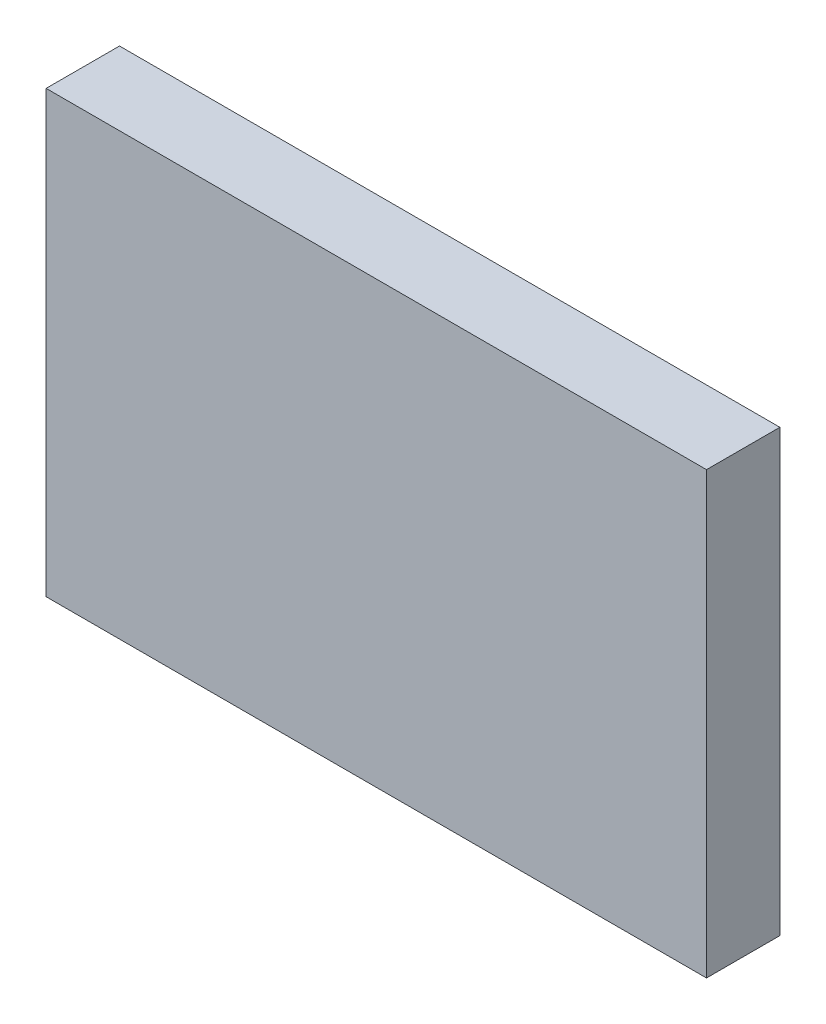
ISO-10303-21;
HEADER;
FILE_DESCRIPTION(('STEP AP214'),'2;1');
FILE_NAME('part.step','',(''),(''),'','','');
FILE_SCHEMA(('AUTOMOTIVE_DESIGN { 1 0 10303 214 1 1 1 1 }'));
ENDSEC;
DATA;
#1=APPLICATION_CONTEXT('core data for automotive mechanical design processes');
#2=APPLICATION_PROTOCOL_DEFINITION('international standard','automotive_design',2000,#1);
#3=PRODUCT_CONTEXT('',#1,'mechanical');
#4=PRODUCT('Part','Part','',(#3));
#5=PRODUCT_RELATED_PRODUCT_CATEGORY('part','',(#4));
#6=PRODUCT_DEFINITION_FORMATION('','',#4);
#7=PRODUCT_DEFINITION_CONTEXT('part definition',#1,'design');
#8=PRODUCT_DEFINITION('design','',#6,#7);
#9=PRODUCT_DEFINITION_SHAPE('','',#8);
#10=(LENGTH_UNIT() NAMED_UNIT(*) SI_UNIT(.MILLI.,.METRE.));
#11=(NAMED_UNIT(*) PLANE_ANGLE_UNIT() SI_UNIT($,.RADIAN.));
#12=(NAMED_UNIT(*) SI_UNIT($,.STERADIAN.) SOLID_ANGLE_UNIT());
#13=UNCERTAINTY_MEASURE_WITH_UNIT(LENGTH_MEASURE(1.E-05),#10,'distance_accuracy_value','');
#14=(GEOMETRIC_REPRESENTATION_CONTEXT(3) GLOBAL_UNCERTAINTY_ASSIGNED_CONTEXT((#13)) GLOBAL_UNIT_ASSIGNED_CONTEXT((#10,
#11,#12)) REPRESENTATION_CONTEXT('',''));
#15=CARTESIAN_POINT('',(0.,0.,0.));
#16=DIRECTION('',(0.,0.,1.));
#17=DIRECTION('',(1.,0.,0.));
#18=AXIS2_PLACEMENT_3D('',#15,#16,#17);
#19=CARTESIAN_POINT('',(0.,0.,20.));
#20=DIRECTION('',(1.,0.,0.));
#21=DIRECTION('',(0.,0.,-1.));
#22=AXIS2_PLACEMENT_3D('',#19,#20,#21);
#23=PLANE('',#22);
#24=DIRECTION('',(0.,-1.,0.));
#25=VECTOR('',#24,1.);
#26=CARTESIAN_POINT('',(0.,0.,0.));
#27=LINE('',#26,#25);
#28=CARTESIAN_POINT('',(0.,120.,0.));
#29=VERTEX_POINT('',#28);
#30=CARTESIAN_POINT('',(0.,0.,0.));
#31=VERTEX_POINT('',#30);
#32=EDGE_CURVE('E114',#29,#31,#27,.T.);
#33=ORIENTED_EDGE('',*,*,#32,.T.);
#34=DIRECTION('',(0.,0.,-1.));
#35=VECTOR('',#34,1.);
#36=CARTESIAN_POINT('',(0.,0.,20.));
#37=LINE('',#36,#35);
#38=CARTESIAN_POINT('',(0.,0.,20.));
#39=VERTEX_POINT('',#38);
#40=EDGE_CURVE('E11',#39,#31,#37,.T.);
#41=ORIENTED_EDGE('',*,*,#40,.F.);
#42=DIRECTION('',(0.,-1.,0.));
#43=VECTOR('',#42,1.);
#44=CARTESIAN_POINT('',(0.,0.,20.));
#45=LINE('',#44,#43);
#46=CARTESIAN_POINT('',(0.,120.,20.));
#47=VERTEX_POINT('',#46);
#48=EDGE_CURVE('E100',#47,#39,#45,.T.);
#49=ORIENTED_EDGE('',*,*,#48,.F.);
#50=DIRECTION('',(0.,0.,-1.));
#51=VECTOR('',#50,1.);
#52=CARTESIAN_POINT('',(0.,120.,20.));
#53=LINE('',#52,#51);
#54=EDGE_CURVE('E108',#47,#29,#53,.T.);
#55=ORIENTED_EDGE('',*,*,#54,.T.);
#56=EDGE_LOOP('',(#33,#41,#49,#55));
#57=FACE_BOUND('',#56,.T.);
#58=ADVANCED_FACE('F44',(#57),#23,.F.);
#59=CARTESIAN_POINT('',(0.,0.,20.));
#60=DIRECTION('',(0.,1.,0.));
#61=DIRECTION('',(0.,0.,1.));
#62=AXIS2_PLACEMENT_3D('',#59,#60,#61);
#63=PLANE('',#62);
#64=DIRECTION('',(1.,0.,0.));
#65=VECTOR('',#64,1.);
#66=CARTESIAN_POINT('',(0.,0.,0.));
#67=LINE('',#66,#65);
#68=CARTESIAN_POINT('',(180.,0.,0.));
#69=VERTEX_POINT('',#68);
#70=EDGE_CURVE('E105',#31,#69,#67,.T.);
#71=ORIENTED_EDGE('',*,*,#70,.T.);
#72=DIRECTION('',(0.,0.,-1.));
#73=VECTOR('',#72,1.);
#74=CARTESIAN_POINT('',(180.,0.,20.));
#75=LINE('',#74,#73);
#76=CARTESIAN_POINT('',(180.,0.,20.));
#77=VERTEX_POINT('',#76);
#78=EDGE_CURVE('E53',#77,#69,#75,.T.);
#79=ORIENTED_EDGE('',*,*,#78,.F.);
#80=DIRECTION('',(1.,0.,0.));
#81=VECTOR('',#80,1.);
#82=CARTESIAN_POINT('',(0.,0.,20.));
#83=LINE('',#82,#81);
#84=EDGE_CURVE('E95',#39,#77,#83,.T.);
#85=ORIENTED_EDGE('',*,*,#84,.F.);
#86=ORIENTED_EDGE('',*,*,#40,.T.);
#87=EDGE_LOOP('',(#71,#79,#85,#86));
#88=FACE_BOUND('',#87,.T.);
#89=ADVANCED_FACE('F101',(#88),#63,.F.);
#90=CARTESIAN_POINT('',(180.,0.,20.));
#91=DIRECTION('',(-1.,0.,0.));
#92=DIRECTION('',(0.,0.,1.));
#93=AXIS2_PLACEMENT_3D('',#90,#91,#92);
#94=PLANE('',#93);
#95=DIRECTION('',(0.,1.,0.));
#96=VECTOR('',#95,1.);
#97=CARTESIAN_POINT('',(180.,0.,0.));
#98=LINE('',#97,#96);
#99=CARTESIAN_POINT('',(180.,120.,0.));
#100=VERTEX_POINT('',#99);
#101=EDGE_CURVE('E76',#69,#100,#98,.T.);
#102=ORIENTED_EDGE('',*,*,#101,.T.);
#103=DIRECTION('',(0.,0.,-1.));
#104=VECTOR('',#103,1.);
#105=CARTESIAN_POINT('',(180.,120.,20.));
#106=LINE('',#105,#104);
#107=CARTESIAN_POINT('',(180.,120.,20.));
#108=VERTEX_POINT('',#107);
#109=EDGE_CURVE('E102',#108,#100,#106,.T.);
#110=ORIENTED_EDGE('',*,*,#109,.F.);
#111=DIRECTION('',(0.,1.,0.));
#112=VECTOR('',#111,1.);
#113=CARTESIAN_POINT('',(180.,0.,20.));
#114=LINE('',#113,#112);
#115=EDGE_CURVE('E92',#77,#108,#114,.T.);
#116=ORIENTED_EDGE('',*,*,#115,.F.);
#117=ORIENTED_EDGE('',*,*,#78,.T.);
#118=EDGE_LOOP('',(#102,#110,#116,#117));
#119=FACE_BOUND('',#118,.T.);
#120=ADVANCED_FACE('F104',(#119),#94,.F.);
#121=CARTESIAN_POINT('',(0.,120.,20.));
#122=DIRECTION('',(0.,-1.,0.));
#123=DIRECTION('',(0.,0.,-1.));
#124=AXIS2_PLACEMENT_3D('',#121,#122,#123);
#125=PLANE('',#124);
#126=DIRECTION('',(-1.,0.,0.));
#127=VECTOR('',#126,1.);
#128=CARTESIAN_POINT('',(0.,120.,0.));
#129=LINE('',#128,#127);
#130=EDGE_CURVE('E82',#100,#29,#129,.T.);
#131=ORIENTED_EDGE('',*,*,#130,.T.);
#132=ORIENTED_EDGE('',*,*,#54,.F.);
#133=DIRECTION('',(-1.,0.,0.));
#134=VECTOR('',#133,1.);
#135=CARTESIAN_POINT('',(0.,120.,20.));
#136=LINE('',#135,#134);
#137=EDGE_CURVE('E65',#108,#47,#136,.T.);
#138=ORIENTED_EDGE('',*,*,#137,.F.);
#139=ORIENTED_EDGE('',*,*,#109,.T.);
#140=EDGE_LOOP('',(#131,#132,#138,#139));
#141=FACE_BOUND('',#140,.T.);
#142=ADVANCED_FACE('F127',(#141),#125,.F.);
#143=CARTESIAN_POINT('',(0.,0.,20.));
#144=DIRECTION('',(0.,0.,-1.));
#145=DIRECTION('',(-1.,0.,0.));
#146=AXIS2_PLACEMENT_3D('',#143,#144,#145);
#147=PLANE('',#146);
#148=ORIENTED_EDGE('',*,*,#48,.T.);
#149=ORIENTED_EDGE('',*,*,#84,.T.);
#150=ORIENTED_EDGE('',*,*,#115,.T.);
#151=ORIENTED_EDGE('',*,*,#137,.T.);
#152=EDGE_LOOP('',(#148,#149,#150,#151));
#153=FACE_BOUND('',#152,.T.);
#154=ADVANCED_FACE('F91',(#153),#147,.F.);
#155=CARTESIAN_POINT('',(0.,0.,0.));
#156=DIRECTION('',(0.,0.,-1.));
#157=DIRECTION('',(-1.,0.,0.));
#158=AXIS2_PLACEMENT_3D('',#155,#156,#157);
#159=PLANE('',#158);
#160=ORIENTED_EDGE('',*,*,#32,.F.);
#161=ORIENTED_EDGE('',*,*,#130,.F.);
#162=ORIENTED_EDGE('',*,*,#101,.F.);
#163=ORIENTED_EDGE('',*,*,#70,.F.);
#164=EDGE_LOOP('',(#160,#161,#162,#163));
#165=FACE_BOUND('',#164,.T.);
#166=ADVANCED_FACE('F129',(#165),#159,.T.);
#167=CLOSED_SHELL('',(#58,#89,#120,#142,#154,#166));
#168=MANIFOLD_SOLID_BREP('B2',#167);
#169=ADVANCED_BREP_SHAPE_REPRESENTATION('',(#18,#168),#14);
#170=SHAPE_DEFINITION_REPRESENTATION(#9,#169);
ENDSEC;
END-ISO-10303-21;
